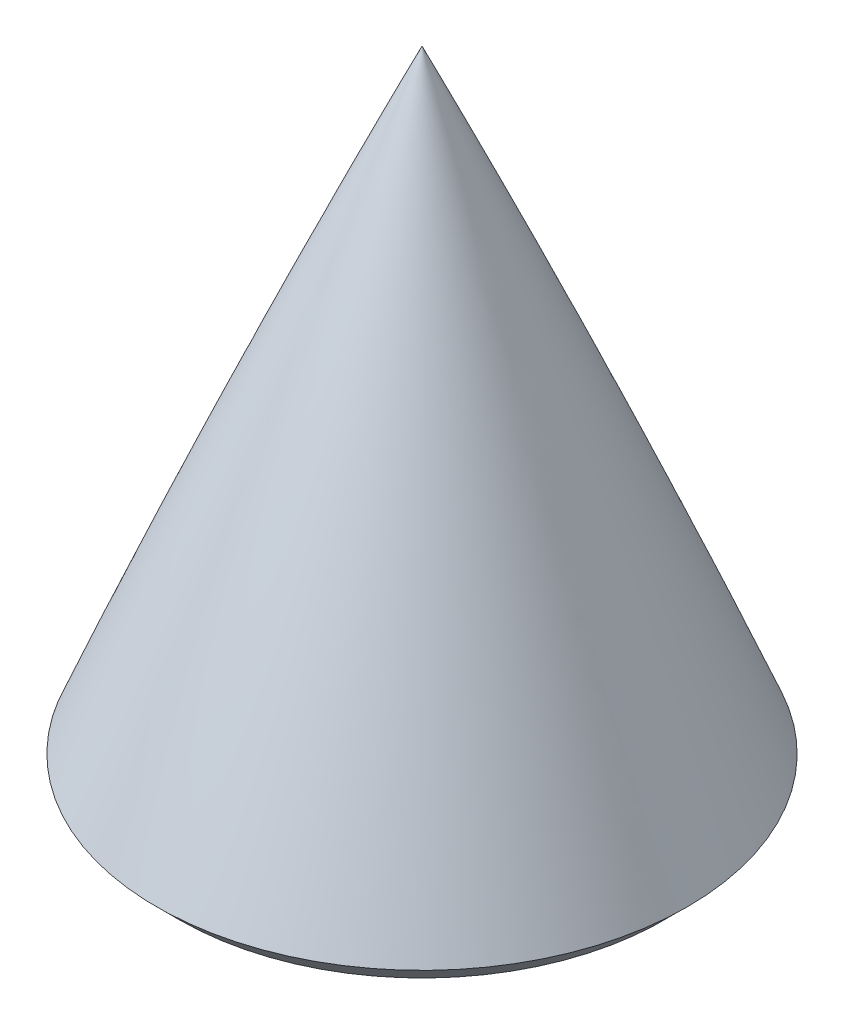
ISO-10303-21;
HEADER;
FILE_DESCRIPTION(('STEP AP214'),'2;1');
FILE_NAME('part.step','',(''),(''),'','','');
FILE_SCHEMA(('AUTOMOTIVE_DESIGN { 1 0 10303 214 1 1 1 1 }'));
ENDSEC;
DATA;
#1=APPLICATION_CONTEXT('core data for automotive mechanical design processes');
#2=APPLICATION_PROTOCOL_DEFINITION('international standard','automotive_design',2000,#1);
#3=PRODUCT_CONTEXT('',#1,'mechanical');
#4=PRODUCT('Part','Part','',(#3));
#5=PRODUCT_RELATED_PRODUCT_CATEGORY('part','',(#4));
#6=PRODUCT_DEFINITION_FORMATION('','',#4);
#7=PRODUCT_DEFINITION_CONTEXT('part definition',#1,'design');
#8=PRODUCT_DEFINITION('design','',#6,#7);
#9=PRODUCT_DEFINITION_SHAPE('','',#8);
#10=(LENGTH_UNIT() NAMED_UNIT(*) SI_UNIT(.MILLI.,.METRE.));
#11=(NAMED_UNIT(*) PLANE_ANGLE_UNIT() SI_UNIT($,.RADIAN.));
#12=(NAMED_UNIT(*) SI_UNIT($,.STERADIAN.) SOLID_ANGLE_UNIT());
#13=UNCERTAINTY_MEASURE_WITH_UNIT(LENGTH_MEASURE(1.E-05),#10,'distance_accuracy_value','');
#14=(GEOMETRIC_REPRESENTATION_CONTEXT(3) GLOBAL_UNCERTAINTY_ASSIGNED_CONTEXT((#13)) GLOBAL_UNIT_ASSIGNED_CONTEXT((#10,
#11,#12)) REPRESENTATION_CONTEXT('',''));
#15=CARTESIAN_POINT('',(0.,0.,0.));
#16=DIRECTION('',(0.,0.,1.));
#17=DIRECTION('',(1.,0.,0.));
#18=AXIS2_PLACEMENT_3D('',#15,#16,#17);
#19=CARTESIAN_POINT('',(-188.314971497888,330.2,83.0177250007011));
#20=DIRECTION('',(0.,-1.,0.));
#21=DIRECTION('',(1.,0.,0.));
#22=AXIS2_PLACEMENT_3D('',#19,#20,#21);
#23=PLANE('',#22);
#24=CARTESIAN_POINT('',(0.,330.2,0.));
#25=DIRECTION('',(0.,-1.,0.));
#26=DIRECTION('',(1.,0.,0.));
#27=AXIS2_PLACEMENT_3D('',#24,#25,#26);
#28=CIRCLE('',#27,18.1610000000001);
#29=CARTESIAN_POINT('',(18.1610000000001,330.2,0.));
#30=VERTEX_POINT('',#29);
#31=EDGE_CURVE('E11',#30,#30,#28,.F.);
#32=ORIENTED_EDGE('',*,*,#31,.F.);
#33=EDGE_LOOP('',(#32));
#34=FACE_BOUND('',#33,.T.);
#35=CARTESIAN_POINT('',(5.66129722309841E-13,330.2,0.));
#36=DIRECTION('',(0.,-1.,0.));
#37=DIRECTION('',(1.,0.,0.));
#38=AXIS2_PLACEMENT_3D('',#35,#36,#37);
#39=CIRCLE('',#38,2.413);
#40=CARTESIAN_POINT('',(2.41300000000057,330.2,0.));
#41=VERTEX_POINT('',#40);
#42=EDGE_CURVE('E67',#41,#41,#39,.T.);
#43=ORIENTED_EDGE('',*,*,#42,.F.);
#44=EDGE_LOOP('',(#43));
#45=FACE_BOUND('',#44,.T.);
#46=ADVANCED_FACE('F41',(#34,#45),#23,.T.);
#47=CARTESIAN_POINT('',(5.87903942398681E-13,342.9,0.));
#48=DIRECTION('',(0.,-1.,0.));
#49=DIRECTION('',(1.,0.,0.));
#50=AXIS2_PLACEMENT_3D('',#47,#48,#49);
#51=CYLINDRICAL_SURFACE('',#50,2.413);
#52=CARTESIAN_POINT('',(5.87903942398681E-13,342.9,0.));
#53=DIRECTION('',(0.,-1.,0.));
#54=DIRECTION('',(1.,0.,0.));
#55=AXIS2_PLACEMENT_3D('',#52,#53,#54);
#56=CIRCLE('',#55,2.413);
#57=CARTESIAN_POINT('',(2.41300000000059,342.9,0.));
#58=VERTEX_POINT('',#57);
#59=EDGE_CURVE('E61',#58,#58,#56,.T.);
#60=ORIENTED_EDGE('',*,*,#59,.F.);
#61=EDGE_LOOP('',(#60));
#62=FACE_BOUND('',#61,.T.);
#63=ORIENTED_EDGE('',*,*,#42,.T.);
#64=EDGE_LOOP('',(#63));
#65=FACE_BOUND('',#64,.T.);
#66=ADVANCED_FACE('F98',(#62,#65),#51,.F.);
#67=CARTESIAN_POINT('',(5.87903942398681E-13,342.9,0.));
#68=DIRECTION('',(0.,-1.,0.));
#69=DIRECTION('',(1.,0.,0.));
#70=AXIS2_PLACEMENT_3D('',#67,#68,#69);
#71=PLANE('',#70);
#72=ORIENTED_EDGE('',*,*,#59,.T.);
#73=EDGE_LOOP('',(#72));
#74=FACE_BOUND('',#73,.T.);
#75=ADVANCED_FACE('F94',(#74),#71,.T.);
#76=CARTESIAN_POINT('',(0.,330.842019050813,0.));
#77=DIRECTION('',(0.,1.,0.));
#78=DIRECTION('',(0.,0.,1.));
#79=AXIS2_PLACEMENT_3D('',#76,#77,#78);
#80=CYLINDRICAL_SURFACE('',#79,18.1610000000001);
#81=ORIENTED_EDGE('',*,*,#31,.T.);
#82=EDGE_LOOP('',(#81));
#83=FACE_BOUND('',#82,.T.);
#84=CARTESIAN_POINT('',(0.,328.295,0.));
#85=DIRECTION('',(0.,1.,0.));
#86=DIRECTION('',(0.,0.,1.));
#87=AXIS2_PLACEMENT_3D('',#84,#85,#86);
#88=CIRCLE('',#87,18.1610000000001);
#89=CARTESIAN_POINT('',(0.,328.295,18.1610000000001));
#90=VERTEX_POINT('',#89);
#91=EDGE_CURVE('E72',#90,#90,#88,.T.);
#92=ORIENTED_EDGE('',*,*,#91,.F.);
#93=EDGE_LOOP('',(#92));
#94=FACE_BOUND('',#93,.T.);
#95=ADVANCED_FACE('F86',(#83,#94),#80,.F.);
#96=CARTESIAN_POINT('',(-18.1610000000001,328.295,0.));
#97=DIRECTION('',(0.,-1.,0.));
#98=DIRECTION('',(0.,0.,-1.));
#99=AXIS2_PLACEMENT_3D('',#96,#97,#98);
#100=PLANE('',#99);
#101=ORIENTED_EDGE('',*,*,#91,.T.);
#102=EDGE_LOOP('',(#101));
#103=FACE_BOUND('',#102,.T.);
#104=CARTESIAN_POINT('',(0.,328.295,0.));
#105=DIRECTION('',(0.,1.,0.));
#106=DIRECTION('',(0.,0.,1.));
#107=AXIS2_PLACEMENT_3D('',#104,#105,#106);
#108=CIRCLE('',#107,20.0659999999999);
#109=CARTESIAN_POINT('',(0.,328.295,20.0659999999999));
#110=VERTEX_POINT('',#109);
#111=EDGE_CURVE('E77',#110,#110,#108,.T.);
#112=ORIENTED_EDGE('',*,*,#111,.F.);
#113=EDGE_LOOP('',(#112));
#114=FACE_BOUND('',#113,.T.);
#115=ADVANCED_FACE('F84',(#103,#114),#100,.T.);
#116=CARTESIAN_POINT('',(0.,330.2,0.));
#117=DIRECTION('',(0.,1.,0.));
#118=DIRECTION('',(0.,0.,1.));
#119=AXIS2_PLACEMENT_3D('',#116,#117,#118);
#120=CONICAL_SURFACE('',#119,21.971,0.785398163397457);
#121=ORIENTED_EDGE('',*,*,#111,.T.);
#122=EDGE_LOOP('',(#121));
#123=FACE_BOUND('',#122,.T.);
#124=CARTESIAN_POINT('',(0.,330.2,0.));
#125=DIRECTION('',(0.,-1.,0.));
#126=DIRECTION('',(1.,0.,0.));
#127=AXIS2_PLACEMENT_3D('',#124,#125,#126);
#128=CIRCLE('',#127,21.9709999999999);
#129=CARTESIAN_POINT('',(21.971,330.2,0.));
#130=VERTEX_POINT('',#129);
#131=EDGE_CURVE('E49',#130,#130,#128,.T.);
#132=ORIENTED_EDGE('',*,*,#131,.T.);
#133=EDGE_LOOP('',(#132));
#134=FACE_BOUND('',#133,.T.);
#135=ADVANCED_FACE('F55',(#123,#134),#120,.T.);
#136=CARTESIAN_POINT('',(992.113492782929,-78.5092148022566,0.));
#137=DIRECTION('',(0.,0.,-1.));
#138=DIRECTION('',(-1.,0.,0.));
#139=AXIS2_PLACEMENT_3D('',#136,#137,#138);
#140=CIRCLE('',#139,1093.36082838655);
#141=TRIMMED_CURVE('',#140,(PARAMETER_VALUE(-0.433745332323453)),
(PARAMETER_VALUE(0.433745332323453)),.T.,.PARAMETER.);
#142=CARTESIAN_POINT('',(-7.7715611723761E-13,-78.5092148022549,0.));
#143=DIRECTION('',(0.,1.,0.));
#144=AXIS1_PLACEMENT('',#142,#143);
#145=SURFACE_OF_REVOLUTION('',#141,#144);
#146=CARTESIAN_POINT('',(0.,381.,0.));
#147=VERTEX_POINT('',#146);
#148=VERTEX_LOOP('',#147);
#149=FACE_BOUND('',#148,.T.);
#150=CARTESIAN_POINT('',(0.,330.2,0.));
#151=DIRECTION('',(0.,-1.,0.));
#152=DIRECTION('',(1.,0.,0.));
#153=AXIS2_PLACEMENT_3D('',#150,#151,#152);
#154=CIRCLE('',#153,21.9844703280578);
#155=CARTESIAN_POINT('',(21.9844703280578,330.2,0.));
#156=VERTEX_POINT('',#155);
#157=EDGE_CURVE('E58',#156,#156,#154,.F.);
#158=ORIENTED_EDGE('',*,*,#157,.T.);
#159=EDGE_LOOP('',(#158));
#160=FACE_BOUND('',#159,.T.);
#161=ADVANCED_FACE('F43',(#149,#160),#145,.T.);
#162=ORIENTED_EDGE('',*,*,#131,.F.);
#163=EDGE_LOOP('',(#162));
#164=FACE_BOUND('',#163,.T.);
#165=ORIENTED_EDGE('',*,*,#157,.F.);
#166=EDGE_LOOP('',(#165));
#167=FACE_BOUND('',#166,.T.);
#168=ADVANCED_FACE('F54',(#164,#167),#23,.T.);
#169=CLOSED_SHELL('',(#46,#66,#75,#95,#115,#135,#161,#168));
#170=MANIFOLD_SOLID_BREP('B2',#169);
#171=ADVANCED_BREP_SHAPE_REPRESENTATION('',(#18,#170),#14);
#172=SHAPE_DEFINITION_REPRESENTATION(#9,#171);
ENDSEC;
END-ISO-10303-21;
